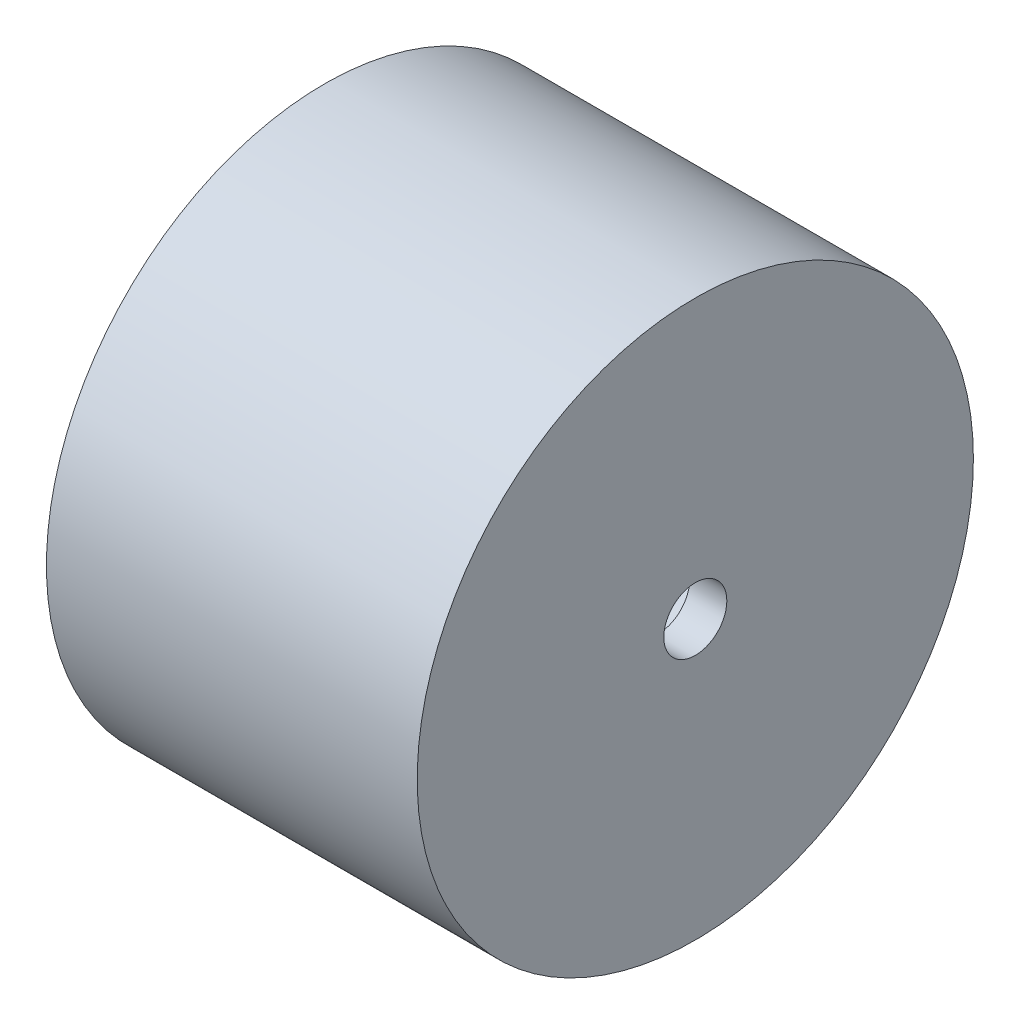
ISO-10303-21;
HEADER;
FILE_DESCRIPTION(('STEP AP214'),'2;1');
FILE_NAME('part.step','',(''),(''),'','','');
FILE_SCHEMA(('AUTOMOTIVE_DESIGN { 1 0 10303 214 1 1 1 1 }'));
ENDSEC;
DATA;
#1=APPLICATION_CONTEXT('core data for automotive mechanical design processes');
#2=APPLICATION_PROTOCOL_DEFINITION('international standard','automotive_design',2000,#1);
#3=PRODUCT_CONTEXT('',#1,'mechanical');
#4=PRODUCT('Part','Part','',(#3));
#5=PRODUCT_RELATED_PRODUCT_CATEGORY('part','',(#4));
#6=PRODUCT_DEFINITION_FORMATION('','',#4);
#7=PRODUCT_DEFINITION_CONTEXT('part definition',#1,'design');
#8=PRODUCT_DEFINITION('design','',#6,#7);
#9=PRODUCT_DEFINITION_SHAPE('','',#8);
#10=(LENGTH_UNIT() NAMED_UNIT(*) SI_UNIT(.MILLI.,.METRE.));
#11=(NAMED_UNIT(*) PLANE_ANGLE_UNIT() SI_UNIT($,.RADIAN.));
#12=(NAMED_UNIT(*) SI_UNIT($,.STERADIAN.) SOLID_ANGLE_UNIT());
#13=UNCERTAINTY_MEASURE_WITH_UNIT(LENGTH_MEASURE(1.E-05),#10,'distance_accuracy_value','');
#14=(GEOMETRIC_REPRESENTATION_CONTEXT(3) GLOBAL_UNCERTAINTY_ASSIGNED_CONTEXT((#13)) GLOBAL_UNIT_ASSIGNED_CONTEXT((#10,
#11,#12)) REPRESENTATION_CONTEXT('',''));
#15=CARTESIAN_POINT('',(0.,0.,0.));
#16=DIRECTION('',(0.,0.,1.));
#17=DIRECTION('',(1.,0.,0.));
#18=AXIS2_PLACEMENT_3D('',#15,#16,#17);
#19=CARTESIAN_POINT('',(20.,0.,0.));
#20=DIRECTION('',(-1.,0.,0.));
#21=DIRECTION('',(0.,0.,1.));
#22=AXIS2_PLACEMENT_3D('',#19,#20,#21);
#23=CYLINDRICAL_SURFACE('',#22,15.);
#24=CARTESIAN_POINT('',(20.,0.,0.));
#25=DIRECTION('',(1.,0.,0.));
#26=DIRECTION('',(0.,0.,-1.));
#27=AXIS2_PLACEMENT_3D('',#24,#25,#26);
#28=CIRCLE('',#27,15.);
#29=CARTESIAN_POINT('',(20.,0.,-15.));
#30=VERTEX_POINT('',#29);
#31=EDGE_CURVE('E10',#30,#30,#28,.T.);
#32=ORIENTED_EDGE('',*,*,#31,.F.);
#33=EDGE_LOOP('',(#32));
#34=FACE_BOUND('',#33,.T.);
#35=CARTESIAN_POINT('',(0.,0.,0.));
#36=DIRECTION('',(1.,0.,0.));
#37=DIRECTION('',(0.,0.,-1.));
#38=AXIS2_PLACEMENT_3D('',#35,#36,#37);
#39=CIRCLE('',#38,15.);
#40=CARTESIAN_POINT('',(0.,0.,-15.));
#41=VERTEX_POINT('',#40);
#42=EDGE_CURVE('E34',#41,#41,#39,.T.);
#43=ORIENTED_EDGE('',*,*,#42,.T.);
#44=EDGE_LOOP('',(#43));
#45=FACE_BOUND('',#44,.T.);
#46=ADVANCED_FACE('F31',(#34,#45),#23,.T.);
#47=CARTESIAN_POINT('',(20.,0.,0.));
#48=DIRECTION('',(1.,0.,0.));
#49=DIRECTION('',(0.,0.,-1.));
#50=AXIS2_PLACEMENT_3D('',#47,#48,#49);
#51=PLANE('',#50);
#52=CARTESIAN_POINT('',(20.,0.,0.));
#53=DIRECTION('',(1.,0.,0.));
#54=DIRECTION('',(0.,0.,-1.));
#55=AXIS2_PLACEMENT_3D('',#52,#53,#54);
#56=CIRCLE('',#55,1.7);
#57=CARTESIAN_POINT('',(20.,0.,-1.7));
#58=VERTEX_POINT('',#57);
#59=EDGE_CURVE('E49',#58,#58,#56,.T.);
#60=ORIENTED_EDGE('',*,*,#59,.F.);
#61=EDGE_LOOP('',(#60));
#62=FACE_BOUND('',#61,.T.);
#63=ORIENTED_EDGE('',*,*,#31,.T.);
#64=EDGE_LOOP('',(#63));
#65=FACE_BOUND('',#64,.T.);
#66=ADVANCED_FACE('F64',(#62,#65),#51,.T.);
#67=CARTESIAN_POINT('',(0.,0.,0.));
#68=DIRECTION('',(1.,0.,0.));
#69=DIRECTION('',(0.,0.,-1.));
#70=AXIS2_PLACEMENT_3D('',#67,#68,#69);
#71=PLANE('',#70);
#72=CARTESIAN_POINT('',(0.,0.,0.));
#73=DIRECTION('',(1.,0.,0.));
#74=DIRECTION('',(0.,0.,-1.));
#75=AXIS2_PLACEMENT_3D('',#72,#73,#74);
#76=CIRCLE('',#75,13.);
#77=CARTESIAN_POINT('',(0.,0.,-13.));
#78=VERTEX_POINT('',#77);
#79=EDGE_CURVE('E43',#78,#78,#76,.T.);
#80=ORIENTED_EDGE('',*,*,#79,.T.);
#81=EDGE_LOOP('',(#80));
#82=FACE_BOUND('',#81,.T.);
#83=ORIENTED_EDGE('',*,*,#42,.F.);
#84=EDGE_LOOP('',(#83));
#85=FACE_BOUND('',#84,.T.);
#86=ADVANCED_FACE('F66',(#82,#85),#71,.F.);
#87=CARTESIAN_POINT('',(20.,0.,0.));
#88=DIRECTION('',(-1.,0.,0.));
#89=DIRECTION('',(0.,0.,1.));
#90=AXIS2_PLACEMENT_3D('',#87,#88,#89);
#91=CYLINDRICAL_SURFACE('',#90,13.);
#92=CARTESIAN_POINT('',(18.,0.,0.));
#93=DIRECTION('',(1.,0.,0.));
#94=DIRECTION('',(0.,0.,-1.));
#95=AXIS2_PLACEMENT_3D('',#92,#93,#94);
#96=CIRCLE('',#95,13.);
#97=CARTESIAN_POINT('',(18.,0.,-13.));
#98=VERTEX_POINT('',#97);
#99=EDGE_CURVE('E41',#98,#98,#96,.T.);
#100=ORIENTED_EDGE('',*,*,#99,.T.);
#101=EDGE_LOOP('',(#100));
#102=FACE_BOUND('',#101,.T.);
#103=ORIENTED_EDGE('',*,*,#79,.F.);
#104=EDGE_LOOP('',(#103));
#105=FACE_BOUND('',#104,.T.);
#106=ADVANCED_FACE('F72',(#102,#105),#91,.F.);
#107=CARTESIAN_POINT('',(18.,0.,0.));
#108=DIRECTION('',(1.,0.,0.));
#109=DIRECTION('',(0.,0.,-1.));
#110=AXIS2_PLACEMENT_3D('',#107,#108,#109);
#111=PLANE('',#110);
#112=CARTESIAN_POINT('',(18.,0.,0.));
#113=DIRECTION('',(1.,0.,0.));
#114=DIRECTION('',(0.,0.,-1.));
#115=AXIS2_PLACEMENT_3D('',#112,#113,#114);
#116=CIRCLE('',#115,1.7);
#117=CARTESIAN_POINT('',(18.,0.,-1.7));
#118=VERTEX_POINT('',#117);
#119=EDGE_CURVE('E46',#118,#118,#116,.T.);
#120=ORIENTED_EDGE('',*,*,#119,.T.);
#121=EDGE_LOOP('',(#120));
#122=FACE_BOUND('',#121,.T.);
#123=ORIENTED_EDGE('',*,*,#99,.F.);
#124=EDGE_LOOP('',(#123));
#125=FACE_BOUND('',#124,.T.);
#126=ADVANCED_FACE('F55',(#122,#125),#111,.F.);
#127=CARTESIAN_POINT('',(18.,0.,0.));
#128=DIRECTION('',(1.,0.,0.));
#129=DIRECTION('',(0.,0.,-1.));
#130=AXIS2_PLACEMENT_3D('',#127,#128,#129);
#131=CYLINDRICAL_SURFACE('',#130,1.7);
#132=ORIENTED_EDGE('',*,*,#119,.F.);
#133=EDGE_LOOP('',(#132));
#134=FACE_BOUND('',#133,.T.);
#135=ORIENTED_EDGE('',*,*,#59,.T.);
#136=EDGE_LOOP('',(#135));
#137=FACE_BOUND('',#136,.T.);
#138=ADVANCED_FACE('F58',(#134,#137),#131,.F.);
#139=CLOSED_SHELL('',(#46,#66,#86,#106,#126,#138));
#140=MANIFOLD_SOLID_BREP('B2',#139);
#141=ADVANCED_BREP_SHAPE_REPRESENTATION('',(#18,#140),#14);
#142=SHAPE_DEFINITION_REPRESENTATION(#9,#141);
ENDSEC;
END-ISO-10303-21;
